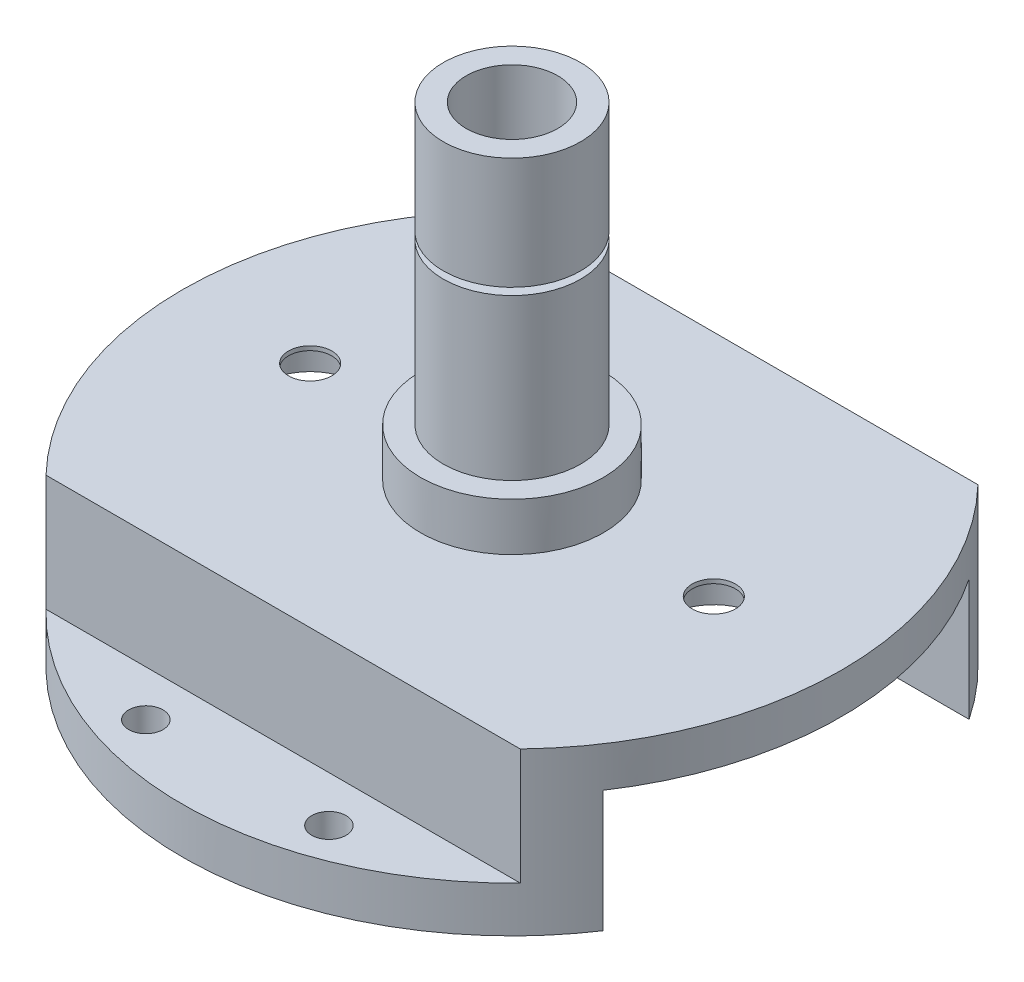
ISO-10303-21;
HEADER;
FILE_DESCRIPTION(('STEP AP214'),'2;1');
FILE_NAME('part.step','',(''),(''),'','','');
FILE_SCHEMA(('AUTOMOTIVE_DESIGN { 1 0 10303 214 1 1 1 1 }'));
ENDSEC;
DATA;
#1=APPLICATION_CONTEXT('core data for automotive mechanical design processes');
#2=APPLICATION_PROTOCOL_DEFINITION('international standard','automotive_design',2000,#1);
#3=PRODUCT_CONTEXT('',#1,'mechanical');
#4=PRODUCT('Part','Part','',(#3));
#5=PRODUCT_RELATED_PRODUCT_CATEGORY('part','',(#4));
#6=PRODUCT_DEFINITION_FORMATION('','',#4);
#7=PRODUCT_DEFINITION_CONTEXT('part definition',#1,'design');
#8=PRODUCT_DEFINITION('design','',#6,#7);
#9=PRODUCT_DEFINITION_SHAPE('','',#8);
#10=(LENGTH_UNIT() NAMED_UNIT(*) SI_UNIT(.MILLI.,.METRE.));
#11=(NAMED_UNIT(*) PLANE_ANGLE_UNIT() SI_UNIT($,.RADIAN.));
#12=(NAMED_UNIT(*) SI_UNIT($,.STERADIAN.) SOLID_ANGLE_UNIT());
#13=UNCERTAINTY_MEASURE_WITH_UNIT(LENGTH_MEASURE(1.E-05),#10,'distance_accuracy_value','');
#14=(GEOMETRIC_REPRESENTATION_CONTEXT(3) GLOBAL_UNCERTAINTY_ASSIGNED_CONTEXT((#13)) GLOBAL_UNIT_ASSIGNED_CONTEXT((#10,
#11,#12)) REPRESENTATION_CONTEXT('',''));
#15=CARTESIAN_POINT('',(0.,0.,0.));
#16=DIRECTION('',(0.,0.,1.));
#17=DIRECTION('',(1.,0.,0.));
#18=AXIS2_PLACEMENT_3D('',#15,#16,#17);
#19=CARTESIAN_POINT('',(0.,-5.587499906,0.));
#20=DIRECTION('',(0.,-1.,0.));
#21=DIRECTION('',(0.,0.,-1.));
#22=AXIS2_PLACEMENT_3D('',#19,#20,#21);
#23=PLANE('',#22);
#24=CARTESIAN_POINT('',(28.,-5.587499906,0.));
#25=DIRECTION('',(0.,-1.,0.));
#26=DIRECTION('',(0.,0.,-1.));
#27=AXIS2_PLACEMENT_3D('',#24,#25,#26);
#28=CIRCLE('',#27,6.50000000000001);
#29=CARTESIAN_POINT('',(28.,-5.587499906,-6.50000000000001));
#30=VERTEX_POINT('',#29);
#31=EDGE_CURVE('E242',#30,#30,#28,.T.);
#32=ORIENTED_EDGE('',*,*,#31,.F.);
#33=EDGE_LOOP('',(#32));
#34=FACE_BOUND('',#33,.T.);
#35=CARTESIAN_POINT('',(-28.,-5.587499906,0.));
#36=DIRECTION('',(0.,-1.,0.));
#37=DIRECTION('',(0.,0.,-1.));
#38=AXIS2_PLACEMENT_3D('',#35,#36,#37);
#39=CIRCLE('',#38,6.5);
#40=CARTESIAN_POINT('',(-28.,-5.587499906,-6.5));
#41=VERTEX_POINT('',#40);
#42=EDGE_CURVE('E168',#41,#41,#39,.T.);
#43=ORIENTED_EDGE('',*,*,#42,.F.);
#44=EDGE_LOOP('',(#43));
#45=FACE_BOUND('',#44,.T.);
#46=CARTESIAN_POINT('',(0.,-5.587499906,0.));
#47=DIRECTION('',(0.,-1.,0.));
#48=DIRECTION('',(0.,0.,-1.));
#49=AXIS2_PLACEMENT_3D('',#46,#47,#48);
#50=CIRCLE('',#49,9.525);
#51=CARTESIAN_POINT('',(0.,-5.587499906,-9.525));
#52=VERTEX_POINT('',#51);
#53=EDGE_CURVE('E125',#52,#52,#50,.T.);
#54=ORIENTED_EDGE('',*,*,#53,.F.);
#55=EDGE_LOOP('',(#54));
#56=FACE_BOUND('',#55,.T.);
#57=CARTESIAN_POINT('',(0.,-5.587499906,0.));
#58=DIRECTION('',(0.,-1.,0.));
#59=DIRECTION('',(0.,0.,-1.));
#60=AXIS2_PLACEMENT_3D('',#57,#58,#59);
#61=CIRCLE('',#60,45.72);
#62=CARTESIAN_POINT('',(38.0152390496232,-5.587499906,-25.4));
#63=VERTEX_POINT('',#62);
#64=CARTESIAN_POINT('',(38.0152390496232,-5.587499906,25.4));
#65=VERTEX_POINT('',#64);
#66=EDGE_CURVE('E123',#63,#65,#61,.T.);
#67=ORIENTED_EDGE('',*,*,#66,.T.);
#68=DIRECTION('',(1.,0.,0.));
#69=VECTOR('',#68,1.);
#70=CARTESIAN_POINT('',(0.,-5.587499906,25.4));
#71=LINE('',#70,#69);
#72=CARTESIAN_POINT('',(-38.0152390496232,-5.587499906,25.4));
#73=VERTEX_POINT('',#72);
#74=EDGE_CURVE('E219',#73,#65,#71,.T.);
#75=ORIENTED_EDGE('',*,*,#74,.F.);
#76=CARTESIAN_POINT('',(-38.0152390496232,-5.587499906,-25.4));
#77=VERTEX_POINT('',#76);
#78=EDGE_CURVE('E121',#73,#77,#61,.T.);
#79=ORIENTED_EDGE('',*,*,#78,.T.);
#80=DIRECTION('',(1.,0.,0.));
#81=VECTOR('',#80,1.);
#82=CARTESIAN_POINT('',(0.,-5.587499906,-25.4));
#83=LINE('',#82,#81);
#84=EDGE_CURVE('E173',#77,#63,#83,.T.);
#85=ORIENTED_EDGE('',*,*,#84,.T.);
#86=EDGE_LOOP('',(#67,#75,#79,#85));
#87=FACE_BOUND('',#86,.T.);
#88=ADVANCED_FACE('F37',(#34,#45,#56,#87),#23,.T.);
#89=CARTESIAN_POINT('',(28.,-5.587499906,0.));
#90=DIRECTION('',(0.,1.,0.));
#91=DIRECTION('',(0.,0.,1.));
#92=AXIS2_PLACEMENT_3D('',#89,#90,#91);
#93=CYLINDRICAL_SURFACE('',#92,3.);
#94=CARTESIAN_POINT('',(28.,0.,0.));
#95=DIRECTION('',(0.,-1.,0.));
#96=DIRECTION('',(0.,0.,-1.));
#97=AXIS2_PLACEMENT_3D('',#94,#95,#96);
#98=CIRCLE('',#97,3.);
#99=CARTESIAN_POINT('',(28.,0.,-3.));
#100=VERTEX_POINT('',#99);
#101=EDGE_CURVE('E252',#100,#100,#98,.T.);
#102=ORIENTED_EDGE('',*,*,#101,.F.);
#103=EDGE_LOOP('',(#102));
#104=FACE_BOUND('',#103,.T.);
#105=CARTESIAN_POINT('',(28.,-0.587499999999999,0.));
#106=DIRECTION('',(0.,-1.,0.));
#107=DIRECTION('',(0.,0.,-1.));
#108=AXIS2_PLACEMENT_3D('',#105,#106,#107);
#109=CIRCLE('',#108,3.);
#110=CARTESIAN_POINT('',(28.,-0.587499999999999,-3.));
#111=VERTEX_POINT('',#110);
#112=EDGE_CURVE('E165',#111,#111,#109,.T.);
#113=ORIENTED_EDGE('',*,*,#112,.T.);
#114=EDGE_LOOP('',(#113));
#115=FACE_BOUND('',#114,.T.);
#116=ADVANCED_FACE('F279',(#104,#115),#93,.F.);
#117=CARTESIAN_POINT('',(-28.,-5.587499906,0.));
#118=DIRECTION('',(0.,1.,0.));
#119=DIRECTION('',(0.,0.,1.));
#120=AXIS2_PLACEMENT_3D('',#117,#118,#119);
#121=CYLINDRICAL_SURFACE('',#120,3.);
#122=CARTESIAN_POINT('',(-28.,0.,0.));
#123=DIRECTION('',(0.,-1.,0.));
#124=DIRECTION('',(0.,0.,-1.));
#125=AXIS2_PLACEMENT_3D('',#122,#123,#124);
#126=CIRCLE('',#125,3.);
#127=CARTESIAN_POINT('',(-28.,0.,-3.));
#128=VERTEX_POINT('',#127);
#129=EDGE_CURVE('E163',#128,#128,#126,.T.);
#130=ORIENTED_EDGE('',*,*,#129,.F.);
#131=EDGE_LOOP('',(#130));
#132=FACE_BOUND('',#131,.T.);
#133=CARTESIAN_POINT('',(-28.,-0.587499999999999,0.));
#134=DIRECTION('',(0.,-1.,0.));
#135=DIRECTION('',(0.,0.,-1.));
#136=AXIS2_PLACEMENT_3D('',#133,#134,#135);
#137=CIRCLE('',#136,3.);
#138=CARTESIAN_POINT('',(-28.,-0.587499999999999,-3.));
#139=VERTEX_POINT('',#138);
#140=EDGE_CURVE('E160',#139,#139,#137,.T.);
#141=ORIENTED_EDGE('',*,*,#140,.T.);
#142=EDGE_LOOP('',(#141));
#143=FACE_BOUND('',#142,.T.);
#144=ADVANCED_FACE('F284',(#132,#143),#121,.F.);
#145=CARTESIAN_POINT('',(0.,45.3898,0.));
#146=DIRECTION('',(0.,-1.,0.));
#147=DIRECTION('',(0.,0.,-1.));
#148=AXIS2_PLACEMENT_3D('',#145,#146,#147);
#149=CYLINDRICAL_SURFACE('',#148,9.525);
#150=CARTESIAN_POINT('',(0.,6.6548,0.));
#151=DIRECTION('',(0.,1.,0.));
#152=DIRECTION('',(0.,0.,1.));
#153=AXIS2_PLACEMENT_3D('',#150,#151,#152);
#154=CIRCLE('',#153,9.525);
#155=CARTESIAN_POINT('',(0.,6.6548,9.525));
#156=VERTEX_POINT('',#155);
#157=EDGE_CURVE('E143',#156,#156,#154,.T.);
#158=ORIENTED_EDGE('',*,*,#157,.T.);
#159=EDGE_LOOP('',(#158));
#160=FACE_BOUND('',#159,.T.);
#161=CARTESIAN_POINT('',(0.,28.8798,0.));
#162=DIRECTION('',(0.,1.,0.));
#163=DIRECTION('',(0.,0.,1.));
#164=AXIS2_PLACEMENT_3D('',#161,#162,#163);
#165=CIRCLE('',#164,9.525);
#166=CARTESIAN_POINT('',(0.,28.8798,9.525));
#167=VERTEX_POINT('',#166);
#168=EDGE_CURVE('E137',#167,#167,#165,.T.);
#169=ORIENTED_EDGE('',*,*,#168,.F.);
#170=EDGE_LOOP('',(#169));
#171=FACE_BOUND('',#170,.T.);
#172=ADVANCED_FACE('F313',(#160,#171),#149,.T.);
#173=CARTESIAN_POINT('',(0.,6.6548,0.));
#174=DIRECTION('',(0.,1.,0.));
#175=DIRECTION('',(0.,0.,1.));
#176=AXIS2_PLACEMENT_3D('',#173,#174,#175);
#177=PLANE('',#176);
#178=CARTESIAN_POINT('',(0.,6.6548,0.));
#179=DIRECTION('',(0.,1.,0.));
#180=DIRECTION('',(0.,0.,1.));
#181=AXIS2_PLACEMENT_3D('',#178,#179,#180);
#182=CIRCLE('',#181,12.7);
#183=CARTESIAN_POINT('',(0.,6.6548,12.7));
#184=VERTEX_POINT('',#183);
#185=EDGE_CURVE('E153',#184,#184,#182,.T.);
#186=ORIENTED_EDGE('',*,*,#185,.T.);
#187=EDGE_LOOP('',(#186));
#188=FACE_BOUND('',#187,.T.);
#189=ORIENTED_EDGE('',*,*,#157,.F.);
#190=EDGE_LOOP('',(#189));
#191=FACE_BOUND('',#190,.T.);
#192=ADVANCED_FACE('F317',(#188,#191),#177,.T.);
#193=CARTESIAN_POINT('',(0.,0.,0.));
#194=DIRECTION('',(0.,1.,0.));
#195=DIRECTION('',(0.,0.,1.));
#196=AXIS2_PLACEMENT_3D('',#193,#194,#195);
#197=PLANE('',#196);
#198=CARTESIAN_POINT('',(0.,0.,0.));
#199=DIRECTION('',(0.,-1.,0.));
#200=DIRECTION('',(0.,0.,-1.));
#201=AXIS2_PLACEMENT_3D('',#198,#199,#200);
#202=CIRCLE('',#201,9.525);
#203=CARTESIAN_POINT('',(0.,0.,-9.525));
#204=VERTEX_POINT('',#203);
#205=EDGE_CURVE('E128',#204,#204,#202,.T.);
#206=ORIENTED_EDGE('',*,*,#205,.T.);
#207=EDGE_LOOP('',(#206));
#208=FACE_BOUND('',#207,.T.);
#209=CARTESIAN_POINT('',(0.,0.,0.));
#210=DIRECTION('',(0.,1.,0.));
#211=DIRECTION('',(0.,0.,1.));
#212=AXIS2_PLACEMENT_3D('',#209,#210,#211);
#213=CIRCLE('',#212,6.35);
#214=CARTESIAN_POINT('',(0.,0.,6.35));
#215=VERTEX_POINT('',#214);
#216=EDGE_CURVE('E148',#215,#215,#213,.T.);
#217=ORIENTED_EDGE('',*,*,#216,.T.);
#218=EDGE_LOOP('',(#217));
#219=FACE_BOUND('',#218,.T.);
#220=ADVANCED_FACE('F260',(#208,#219),#197,.F.);
#221=CARTESIAN_POINT('',(0.,6.6548,0.));
#222=DIRECTION('',(0.,-1.,0.));
#223=DIRECTION('',(0.,0.,-1.));
#224=AXIS2_PLACEMENT_3D('',#221,#222,#223);
#225=CYLINDRICAL_SURFACE('',#224,12.7);
#226=ORIENTED_EDGE('',*,*,#185,.F.);
#227=EDGE_LOOP('',(#226));
#228=FACE_BOUND('',#227,.T.);
#229=CARTESIAN_POINT('',(0.,0.,0.));
#230=DIRECTION('',(0.,-1.,0.));
#231=DIRECTION('',(0.,0.,-1.));
#232=AXIS2_PLACEMENT_3D('',#229,#230,#231);
#233=CIRCLE('',#232,12.7);
#234=CARTESIAN_POINT('',(0.,0.,-12.7));
#235=VERTEX_POINT('',#234);
#236=EDGE_CURVE('E130',#235,#235,#233,.T.);
#237=ORIENTED_EDGE('',*,*,#236,.F.);
#238=EDGE_LOOP('',(#237));
#239=FACE_BOUND('',#238,.T.);
#240=ADVANCED_FACE('F39',(#228,#239),#225,.T.);
#241=CARTESIAN_POINT('',(0.,6.6548,0.));
#242=DIRECTION('',(0.,-1.,0.));
#243=DIRECTION('',(0.,0.,-1.));
#244=AXIS2_PLACEMENT_3D('',#241,#242,#243);
#245=CYLINDRICAL_SURFACE('',#244,6.35);
#246=ORIENTED_EDGE('',*,*,#216,.F.);
#247=EDGE_LOOP('',(#246));
#248=FACE_BOUND('',#247,.T.);
#249=CARTESIAN_POINT('',(0.,45.3898,0.));
#250=DIRECTION('',(0.,1.,0.));
#251=DIRECTION('',(0.,0.,1.));
#252=AXIS2_PLACEMENT_3D('',#249,#250,#251);
#253=CIRCLE('',#252,6.35);
#254=CARTESIAN_POINT('',(0.,45.3898,6.35));
#255=VERTEX_POINT('',#254);
#256=EDGE_CURVE('E140',#255,#255,#253,.T.);
#257=ORIENTED_EDGE('',*,*,#256,.T.);
#258=EDGE_LOOP('',(#257));
#259=FACE_BOUND('',#258,.T.);
#260=ADVANCED_FACE('F308',(#248,#259),#245,.F.);
#261=CARTESIAN_POINT('',(0.,45.3898,0.));
#262=DIRECTION('',(0.,1.,0.));
#263=DIRECTION('',(0.,0.,1.));
#264=AXIS2_PLACEMENT_3D('',#261,#262,#263);
#265=PLANE('',#264);
#266=CARTESIAN_POINT('',(0.,45.3898,0.));
#267=DIRECTION('',(0.,1.,0.));
#268=DIRECTION('',(0.,0.,1.));
#269=AXIS2_PLACEMENT_3D('',#266,#267,#268);
#270=CIRCLE('',#269,9.525);
#271=CARTESIAN_POINT('',(0.,45.3898,9.525));
#272=VERTEX_POINT('',#271);
#273=EDGE_CURVE('E145',#272,#272,#270,.T.);
#274=ORIENTED_EDGE('',*,*,#273,.T.);
#275=EDGE_LOOP('',(#274));
#276=FACE_BOUND('',#275,.T.);
#277=ORIENTED_EDGE('',*,*,#256,.F.);
#278=EDGE_LOOP('',(#277));
#279=FACE_BOUND('',#278,.T.);
#280=ADVANCED_FACE('F305',(#276,#279),#265,.T.);
#281=CARTESIAN_POINT('',(0.,29.8704,0.));
#282=DIRECTION('',(0.,1.,0.));
#283=DIRECTION('',(0.,0.,1.));
#284=AXIS2_PLACEMENT_3D('',#281,#282,#283);
#285=CIRCLE('',#284,9.525);
#286=CARTESIAN_POINT('',(0.,29.8704,9.525));
#287=VERTEX_POINT('',#286);
#288=EDGE_CURVE('E144',#287,#287,#285,.T.);
#289=ORIENTED_EDGE('',*,*,#288,.T.);
#290=EDGE_LOOP('',(#289));
#291=FACE_BOUND('',#290,.T.);
#292=ORIENTED_EDGE('',*,*,#273,.F.);
#293=EDGE_LOOP('',(#292));
#294=FACE_BOUND('',#293,.T.);
#295=ADVANCED_FACE('F300',(#291,#294),#149,.T.);
#296=CARTESIAN_POINT('',(0.,29.8704,0.));
#297=DIRECTION('',(0.,1.,0.));
#298=DIRECTION('',(0.,0.,1.));
#299=AXIS2_PLACEMENT_3D('',#296,#297,#298);
#300=PLANE('',#299);
#301=CARTESIAN_POINT('',(0.,29.8704,0.));
#302=DIRECTION('',(0.,1.,0.));
#303=DIRECTION('',(0.,0.,1.));
#304=AXIS2_PLACEMENT_3D('',#301,#302,#303);
#305=CIRCLE('',#304,7.4676);
#306=CARTESIAN_POINT('',(0.,29.8704,7.4676));
#307=VERTEX_POINT('',#306);
#308=EDGE_CURVE('E134',#307,#307,#305,.T.);
#309=ORIENTED_EDGE('',*,*,#308,.T.);
#310=EDGE_LOOP('',(#309));
#311=FACE_BOUND('',#310,.T.);
#312=ORIENTED_EDGE('',*,*,#288,.F.);
#313=EDGE_LOOP('',(#312));
#314=FACE_BOUND('',#313,.T.);
#315=ADVANCED_FACE('F297',(#311,#314),#300,.F.);
#316=CARTESIAN_POINT('',(0.,28.8798,0.));
#317=DIRECTION('',(0.,1.,0.));
#318=DIRECTION('',(0.,0.,1.));
#319=AXIS2_PLACEMENT_3D('',#316,#317,#318);
#320=PLANE('',#319);
#321=CARTESIAN_POINT('',(0.,28.8798,0.));
#322=DIRECTION('',(0.,1.,0.));
#323=DIRECTION('',(0.,0.,1.));
#324=AXIS2_PLACEMENT_3D('',#321,#322,#323);
#325=CIRCLE('',#324,7.4676);
#326=CARTESIAN_POINT('',(0.,28.8798,7.4676));
#327=VERTEX_POINT('',#326);
#328=EDGE_CURVE('E133',#327,#327,#325,.T.);
#329=ORIENTED_EDGE('',*,*,#328,.F.);
#330=EDGE_LOOP('',(#329));
#331=FACE_BOUND('',#330,.T.);
#332=ORIENTED_EDGE('',*,*,#168,.T.);
#333=EDGE_LOOP('',(#332));
#334=FACE_BOUND('',#333,.T.);
#335=ADVANCED_FACE('F295',(#331,#334),#320,.T.);
#336=CARTESIAN_POINT('',(0.,29.8704,0.));
#337=DIRECTION('',(0.,-1.,0.));
#338=DIRECTION('',(0.,0.,-1.));
#339=AXIS2_PLACEMENT_3D('',#336,#337,#338);
#340=CYLINDRICAL_SURFACE('',#339,7.4676);
#341=ORIENTED_EDGE('',*,*,#308,.F.);
#342=EDGE_LOOP('',(#341));
#343=FACE_BOUND('',#342,.T.);
#344=ORIENTED_EDGE('',*,*,#328,.T.);
#345=EDGE_LOOP('',(#344));
#346=FACE_BOUND('',#345,.T.);
#347=ADVANCED_FACE('F290',(#343,#346),#340,.T.);
#348=CARTESIAN_POINT('',(0.,0.,0.));
#349=DIRECTION('',(0.,-1.,0.));
#350=DIRECTION('',(0.,0.,-1.));
#351=AXIS2_PLACEMENT_3D('',#348,#349,#350);
#352=PLANE('',#351);
#353=ORIENTED_EDGE('',*,*,#129,.T.);
#354=EDGE_LOOP('',(#353));
#355=FACE_BOUND('',#354,.T.);
#356=CARTESIAN_POINT('',(0.,0.,0.));
#357=DIRECTION('',(0.,-1.,0.));
#358=DIRECTION('',(0.,0.,-1.));
#359=AXIS2_PLACEMENT_3D('',#356,#357,#358);
#360=CIRCLE('',#359,45.72);
#361=CARTESIAN_POINT('',(32.8976579713511,0.,-31.75));
#362=VERTEX_POINT('',#361);
#363=CARTESIAN_POINT('',(32.8976579713511,0.,31.75));
#364=VERTEX_POINT('',#363);
#365=EDGE_CURVE('E116',#362,#364,#360,.T.);
#366=ORIENTED_EDGE('',*,*,#365,.F.);
#367=DIRECTION('',(1.,0.,0.));
#368=VECTOR('',#367,1.);
#369=CARTESIAN_POINT('',(45.72,0.,-31.75));
#370=LINE('',#369,#368);
#371=CARTESIAN_POINT('',(-32.8976579713511,0.,-31.75));
#372=VERTEX_POINT('',#371);
#373=EDGE_CURVE('E105',#372,#362,#370,.T.);
#374=ORIENTED_EDGE('',*,*,#373,.F.);
#375=CARTESIAN_POINT('',(-32.8976579713511,0.,31.75));
#376=VERTEX_POINT('',#375);
#377=EDGE_CURVE('E115',#376,#372,#360,.T.);
#378=ORIENTED_EDGE('',*,*,#377,.F.);
#379=DIRECTION('',(-1.,0.,0.));
#380=VECTOR('',#379,1.);
#381=CARTESIAN_POINT('',(45.72,0.,31.75));
#382=LINE('',#381,#380);
#383=EDGE_CURVE('E200',#364,#376,#382,.T.);
#384=ORIENTED_EDGE('',*,*,#383,.F.);
#385=EDGE_LOOP('',(#366,#374,#378,#384));
#386=FACE_BOUND('',#385,.T.);
#387=ORIENTED_EDGE('',*,*,#101,.T.);
#388=EDGE_LOOP('',(#387));
#389=FACE_BOUND('',#388,.T.);
#390=ORIENTED_EDGE('',*,*,#236,.T.);
#391=EDGE_LOOP('',(#390));
#392=FACE_BOUND('',#391,.T.);
#393=ADVANCED_FACE('F112',(#355,#386,#389,#392),#352,.F.);
#394=CARTESIAN_POINT('',(0.,-5.587499906,0.));
#395=DIRECTION('',(0.,1.,0.));
#396=DIRECTION('',(0.,0.,1.));
#397=AXIS2_PLACEMENT_3D('',#394,#395,#396);
#398=CYLINDRICAL_SURFACE('',#397,45.72);
#399=ORIENTED_EDGE('',*,*,#66,.F.);
#400=DIRECTION('',(0.,1.,0.));
#401=VECTOR('',#400,1.);
#402=CARTESIAN_POINT('',(38.0152390496232,-22.462499906,-25.4));
#403=LINE('',#402,#401);
#404=CARTESIAN_POINT('',(38.0152390496232,-22.462499906,-25.4));
#405=VERTEX_POINT('',#404);
#406=EDGE_CURVE('E237',#405,#63,#403,.T.);
#407=ORIENTED_EDGE('',*,*,#406,.F.);
#408=CARTESIAN_POINT('',(0.,-22.462499906,0.));
#409=DIRECTION('',(0.,-1.,0.));
#410=DIRECTION('',(0.,0.,-1.));
#411=AXIS2_PLACEMENT_3D('',#408,#409,#410);
#412=CIRCLE('',#411,45.72);
#413=CARTESIAN_POINT('',(-38.0152390496232,-22.462499906,-25.4));
#414=VERTEX_POINT('',#413);
#415=EDGE_CURVE('E236',#414,#405,#412,.T.);
#416=ORIENTED_EDGE('',*,*,#415,.F.);
#417=DIRECTION('',(0.,1.,0.));
#418=VECTOR('',#417,1.);
#419=CARTESIAN_POINT('',(-38.0152390496232,-22.462499906,-25.4));
#420=LINE('',#419,#418);
#421=EDGE_CURVE('E245',#414,#77,#420,.T.);
#422=ORIENTED_EDGE('',*,*,#421,.T.);
#423=ORIENTED_EDGE('',*,*,#78,.F.);
#424=DIRECTION('',(0.,1.,0.));
#425=VECTOR('',#424,1.);
#426=CARTESIAN_POINT('',(-38.0152390496232,-22.462499906,25.4));
#427=LINE('',#426,#425);
#428=CARTESIAN_POINT('',(-38.0152390496232,-22.462499906,25.4));
#429=VERTEX_POINT('',#428);
#430=EDGE_CURVE('E230',#429,#73,#427,.T.);
#431=ORIENTED_EDGE('',*,*,#430,.F.);
#432=CARTESIAN_POINT('',(0.,-22.462499906,0.));
#433=DIRECTION('',(0.,-1.,0.));
#434=DIRECTION('',(0.,0.,-1.));
#435=AXIS2_PLACEMENT_3D('',#432,#433,#434);
#436=CIRCLE('',#435,45.72);
#437=CARTESIAN_POINT('',(38.0152390496232,-22.462499906,25.4));
#438=VERTEX_POINT('',#437);
#439=EDGE_CURVE('E220',#438,#429,#436,.T.);
#440=ORIENTED_EDGE('',*,*,#439,.F.);
#441=DIRECTION('',(0.,1.,0.));
#442=VECTOR('',#441,1.);
#443=CARTESIAN_POINT('',(38.0152390496232,-22.462499906,25.4));
#444=LINE('',#443,#442);
#445=EDGE_CURVE('E225',#438,#65,#444,.T.);
#446=ORIENTED_EDGE('',*,*,#445,.T.);
#447=EDGE_LOOP('',(#399,#407,#416,#422,#423,#431,#440,#446));
#448=FACE_BOUND('',#447,.T.);
#449=CARTESIAN_POINT('',(0.,-16.112499906,0.));
#450=DIRECTION('',(0.,-1.,0.));
#451=DIRECTION('',(0.,0.,-1.));
#452=AXIS2_PLACEMENT_3D('',#449,#450,#451);
#453=CIRCLE('',#452,45.72);
#454=CARTESIAN_POINT('',(-32.8976579713511,-16.112499906,-31.75));
#455=VERTEX_POINT('',#454);
#456=CARTESIAN_POINT('',(32.8976579713511,-16.112499906,-31.75));
#457=VERTEX_POINT('',#456);
#458=EDGE_CURVE('E194',#455,#457,#453,.T.);
#459=ORIENTED_EDGE('',*,*,#458,.T.);
#460=DIRECTION('',(0.,1.,0.));
#461=VECTOR('',#460,1.);
#462=CARTESIAN_POINT('',(32.8976579713511,-5.587499906,-31.75));
#463=LINE('',#462,#461);
#464=EDGE_CURVE('E13',#457,#362,#463,.T.);
#465=ORIENTED_EDGE('',*,*,#464,.T.);
#466=ORIENTED_EDGE('',*,*,#365,.T.);
#467=DIRECTION('',(0.,1.,0.));
#468=VECTOR('',#467,1.);
#469=CARTESIAN_POINT('',(32.8976579713511,-5.587499906,31.75));
#470=LINE('',#469,#468);
#471=CARTESIAN_POINT('',(32.8976579713511,-16.112499906,31.75));
#472=VERTEX_POINT('',#471);
#473=EDGE_CURVE('E108',#364,#472,#470,.F.);
#474=ORIENTED_EDGE('',*,*,#473,.T.);
#475=CARTESIAN_POINT('',(0.,-16.112499906,0.));
#476=DIRECTION('',(0.,-1.,0.));
#477=DIRECTION('',(0.,0.,-1.));
#478=AXIS2_PLACEMENT_3D('',#475,#476,#477);
#479=CIRCLE('',#478,45.72);
#480=CARTESIAN_POINT('',(-32.8976579713511,-16.112499906,31.75));
#481=VERTEX_POINT('',#480);
#482=EDGE_CURVE('E205',#472,#481,#479,.T.);
#483=ORIENTED_EDGE('',*,*,#482,.T.);
#484=DIRECTION('',(0.,1.,0.));
#485=VECTOR('',#484,1.);
#486=CARTESIAN_POINT('',(-32.8976579713511,-5.587499906,31.75));
#487=LINE('',#486,#485);
#488=EDGE_CURVE('E120',#481,#376,#487,.T.);
#489=ORIENTED_EDGE('',*,*,#488,.T.);
#490=ORIENTED_EDGE('',*,*,#377,.T.);
#491=DIRECTION('',(0.,1.,0.));
#492=VECTOR('',#491,1.);
#493=CARTESIAN_POINT('',(-32.8976579713511,-5.587499906,-31.75));
#494=LINE('',#493,#492);
#495=EDGE_CURVE('E45',#372,#455,#494,.F.);
#496=ORIENTED_EDGE('',*,*,#495,.T.);
#497=EDGE_LOOP('',(#459,#465,#466,#474,#483,#489,#490,#496));
#498=FACE_BOUND('',#497,.T.);
#499=ADVANCED_FACE('F119',(#448,#498),#398,.T.);
#500=CARTESIAN_POINT('',(0.,-5.587499906,0.));
#501=DIRECTION('',(0.,1.,0.));
#502=DIRECTION('',(0.,0.,1.));
#503=AXIS2_PLACEMENT_3D('',#500,#501,#502);
#504=CYLINDRICAL_SURFACE('',#503,9.525);
#505=ORIENTED_EDGE('',*,*,#53,.T.);
#506=EDGE_LOOP('',(#505));
#507=FACE_BOUND('',#506,.T.);
#508=ORIENTED_EDGE('',*,*,#205,.F.);
#509=EDGE_LOOP('',(#508));
#510=FACE_BOUND('',#509,.T.);
#511=ADVANCED_FACE('F263',(#507,#510),#504,.F.);
#512=CARTESIAN_POINT('',(-28.,-0.587499999999999,0.));
#513=DIRECTION('',(0.,-1.,0.));
#514=DIRECTION('',(0.,0.,-1.));
#515=AXIS2_PLACEMENT_3D('',#512,#513,#514);
#516=CYLINDRICAL_SURFACE('',#515,6.5);
#517=CARTESIAN_POINT('',(-28.,-0.587499999999999,0.));
#518=DIRECTION('',(0.,-1.,0.));
#519=DIRECTION('',(0.,0.,-1.));
#520=AXIS2_PLACEMENT_3D('',#517,#518,#519);
#521=CIRCLE('',#520,6.5);
#522=CARTESIAN_POINT('',(-28.,-0.587499999999999,-6.5));
#523=VERTEX_POINT('',#522);
#524=EDGE_CURVE('E164',#523,#523,#521,.T.);
#525=ORIENTED_EDGE('',*,*,#524,.F.);
#526=EDGE_LOOP('',(#525));
#527=FACE_BOUND('',#526,.T.);
#528=ORIENTED_EDGE('',*,*,#42,.T.);
#529=EDGE_LOOP('',(#528));
#530=FACE_BOUND('',#529,.T.);
#531=ADVANCED_FACE('F265',(#527,#530),#516,.F.);
#532=CARTESIAN_POINT('',(-28.,-0.587499999999999,0.));
#533=DIRECTION('',(0.,-1.,0.));
#534=DIRECTION('',(0.,0.,-1.));
#535=AXIS2_PLACEMENT_3D('',#532,#533,#534);
#536=PLANE('',#535);
#537=ORIENTED_EDGE('',*,*,#140,.F.);
#538=EDGE_LOOP('',(#537));
#539=FACE_BOUND('',#538,.T.);
#540=ORIENTED_EDGE('',*,*,#524,.T.);
#541=EDGE_LOOP('',(#540));
#542=FACE_BOUND('',#541,.T.);
#543=ADVANCED_FACE('F271',(#539,#542),#536,.T.);
#544=CARTESIAN_POINT('',(28.,-0.587499999999999,0.));
#545=DIRECTION('',(0.,-1.,0.));
#546=DIRECTION('',(0.,0.,-1.));
#547=AXIS2_PLACEMENT_3D('',#544,#545,#546);
#548=CYLINDRICAL_SURFACE('',#547,6.50000000000001);
#549=CARTESIAN_POINT('',(28.,-0.587499999999999,0.));
#550=DIRECTION('',(0.,-1.,0.));
#551=DIRECTION('',(0.,0.,-1.));
#552=AXIS2_PLACEMENT_3D('',#549,#550,#551);
#553=CIRCLE('',#552,6.50000000000001);
#554=CARTESIAN_POINT('',(28.,-0.587499999999999,-6.50000000000001));
#555=VERTEX_POINT('',#554);
#556=EDGE_CURVE('E169',#555,#555,#553,.T.);
#557=ORIENTED_EDGE('',*,*,#556,.F.);
#558=EDGE_LOOP('',(#557));
#559=FACE_BOUND('',#558,.T.);
#560=ORIENTED_EDGE('',*,*,#31,.T.);
#561=EDGE_LOOP('',(#560));
#562=FACE_BOUND('',#561,.T.);
#563=ADVANCED_FACE('F350',(#559,#562),#548,.F.);
#564=CARTESIAN_POINT('',(28.,-0.587499999999999,0.));
#565=DIRECTION('',(0.,-1.,0.));
#566=DIRECTION('',(0.,0.,-1.));
#567=AXIS2_PLACEMENT_3D('',#564,#565,#566);
#568=PLANE('',#567);
#569=ORIENTED_EDGE('',*,*,#112,.F.);
#570=EDGE_LOOP('',(#569));
#571=FACE_BOUND('',#570,.T.);
#572=ORIENTED_EDGE('',*,*,#556,.T.);
#573=EDGE_LOOP('',(#572));
#574=FACE_BOUND('',#573,.T.);
#575=ADVANCED_FACE('F354',(#571,#574),#568,.T.);
#576=CARTESIAN_POINT('',(0.,-22.462499906,-25.4));
#577=DIRECTION('',(0.,0.,1.));
#578=DIRECTION('',(1.,0.,0.));
#579=AXIS2_PLACEMENT_3D('',#576,#577,#578);
#580=PLANE('',#579);
#581=ORIENTED_EDGE('',*,*,#84,.F.);
#582=ORIENTED_EDGE('',*,*,#421,.F.);
#583=DIRECTION('',(1.,0.,0.));
#584=VECTOR('',#583,1.);
#585=CARTESIAN_POINT('',(0.,-22.462499906,-25.4));
#586=LINE('',#585,#584);
#587=EDGE_CURVE('E233',#414,#405,#586,.T.);
#588=ORIENTED_EDGE('',*,*,#587,.T.);
#589=ORIENTED_EDGE('',*,*,#406,.T.);
#590=EDGE_LOOP('',(#581,#582,#588,#589));
#591=FACE_BOUND('',#590,.T.);
#592=ADVANCED_FACE('F358',(#591),#580,.T.);
#593=CARTESIAN_POINT('',(0.,-22.462499906,0.));
#594=DIRECTION('',(0.,-1.,0.));
#595=DIRECTION('',(0.,0.,-1.));
#596=AXIS2_PLACEMENT_3D('',#593,#594,#595);
#597=PLANE('',#596);
#598=CARTESIAN_POINT('',(12.7,-22.462499906,-38.1));
#599=DIRECTION('',(0.,-1.,0.));
#600=DIRECTION('',(0.,0.,1.));
#601=AXIS2_PLACEMENT_3D('',#598,#599,#600);
#602=CIRCLE('',#601,2.38125);
#603=CARTESIAN_POINT('',(12.7,-22.462499906,-35.71875));
#604=VERTEX_POINT('',#603);
#605=EDGE_CURVE('E207',#604,#604,#602,.T.);
#606=ORIENTED_EDGE('',*,*,#605,.F.);
#607=EDGE_LOOP('',(#606));
#608=FACE_BOUND('',#607,.T.);
#609=CARTESIAN_POINT('',(-12.7,-22.462499906,-38.1));
#610=DIRECTION('',(0.,-1.,0.));
#611=DIRECTION('',(0.,0.,1.));
#612=AXIS2_PLACEMENT_3D('',#609,#610,#611);
#613=CIRCLE('',#612,2.38125);
#614=CARTESIAN_POINT('',(-12.7,-22.462499906,-35.71875));
#615=VERTEX_POINT('',#614);
#616=EDGE_CURVE('E210',#615,#615,#613,.T.);
#617=ORIENTED_EDGE('',*,*,#616,.F.);
#618=EDGE_LOOP('',(#617));
#619=FACE_BOUND('',#618,.T.);
#620=ORIENTED_EDGE('',*,*,#587,.F.);
#621=ORIENTED_EDGE('',*,*,#415,.T.);
#622=EDGE_LOOP('',(#620,#621));
#623=FACE_BOUND('',#622,.T.);
#624=ADVANCED_FACE('F362',(#608,#619,#623),#597,.T.);
#625=CARTESIAN_POINT('',(0.,-22.462499906,25.4));
#626=DIRECTION('',(0.,0.,1.));
#627=DIRECTION('',(1.,0.,0.));
#628=AXIS2_PLACEMENT_3D('',#625,#626,#627);
#629=PLANE('',#628);
#630=ORIENTED_EDGE('',*,*,#74,.T.);
#631=ORIENTED_EDGE('',*,*,#445,.F.);
#632=DIRECTION('',(1.,0.,0.));
#633=VECTOR('',#632,1.);
#634=CARTESIAN_POINT('',(0.,-22.462499906,25.4));
#635=LINE('',#634,#633);
#636=EDGE_CURVE('E223',#429,#438,#635,.T.);
#637=ORIENTED_EDGE('',*,*,#636,.F.);
#638=ORIENTED_EDGE('',*,*,#430,.T.);
#639=EDGE_LOOP('',(#630,#631,#637,#638));
#640=FACE_BOUND('',#639,.T.);
#641=ADVANCED_FACE('F366',(#640),#629,.F.);
#642=CARTESIAN_POINT('',(0.,-22.462499906,0.));
#643=DIRECTION('',(0.,-1.,0.));
#644=DIRECTION('',(0.,0.,-1.));
#645=AXIS2_PLACEMENT_3D('',#642,#643,#644);
#646=PLANE('',#645);
#647=CARTESIAN_POINT('',(-12.7,-22.462499906,38.1));
#648=DIRECTION('',(0.,-1.,0.));
#649=DIRECTION('',(0.,0.,-1.));
#650=AXIS2_PLACEMENT_3D('',#647,#648,#649);
#651=CIRCLE('',#650,2.38125);
#652=CARTESIAN_POINT('',(-12.7,-22.462499906,35.71875));
#653=VERTEX_POINT('',#652);
#654=EDGE_CURVE('E213',#653,#653,#651,.T.);
#655=ORIENTED_EDGE('',*,*,#654,.F.);
#656=EDGE_LOOP('',(#655));
#657=FACE_BOUND('',#656,.T.);
#658=CARTESIAN_POINT('',(12.7,-22.462499906,38.1));
#659=DIRECTION('',(0.,-1.,0.));
#660=DIRECTION('',(0.,0.,-1.));
#661=AXIS2_PLACEMENT_3D('',#658,#659,#660);
#662=CIRCLE('',#661,2.38125);
#663=CARTESIAN_POINT('',(12.7,-22.462499906,35.71875));
#664=VERTEX_POINT('',#663);
#665=EDGE_CURVE('E216',#664,#664,#662,.T.);
#666=ORIENTED_EDGE('',*,*,#665,.F.);
#667=EDGE_LOOP('',(#666));
#668=FACE_BOUND('',#667,.T.);
#669=ORIENTED_EDGE('',*,*,#439,.T.);
#670=ORIENTED_EDGE('',*,*,#636,.T.);
#671=EDGE_LOOP('',(#669,#670));
#672=FACE_BOUND('',#671,.T.);
#673=ADVANCED_FACE('F370',(#657,#668,#672),#646,.T.);
#674=CARTESIAN_POINT('',(12.7,6.73519209080187,38.1));
#675=DIRECTION('',(0.,-1.,0.));
#676=DIRECTION('',(0.,0.,-1.));
#677=AXIS2_PLACEMENT_3D('',#674,#675,#676);
#678=CYLINDRICAL_SURFACE('',#677,2.38125);
#679=CARTESIAN_POINT('',(12.7,-16.112499906,38.1));
#680=DIRECTION('',(0.,-1.,0.));
#681=DIRECTION('',(0.,0.,-1.));
#682=AXIS2_PLACEMENT_3D('',#679,#680,#681);
#683=CIRCLE('',#682,2.38125);
#684=CARTESIAN_POINT('',(12.7,-16.112499906,35.71875));
#685=VERTEX_POINT('',#684);
#686=EDGE_CURVE('E184',#685,#685,#683,.F.);
#687=ORIENTED_EDGE('',*,*,#686,.T.);
#688=EDGE_LOOP('',(#687));
#689=FACE_BOUND('',#688,.T.);
#690=ORIENTED_EDGE('',*,*,#665,.T.);
#691=EDGE_LOOP('',(#690));
#692=FACE_BOUND('',#691,.T.);
#693=ADVANCED_FACE('F374',(#689,#692),#678,.F.);
#694=CARTESIAN_POINT('',(-12.7,6.73519209080187,38.1));
#695=DIRECTION('',(0.,-1.,0.));
#696=DIRECTION('',(0.,0.,-1.));
#697=AXIS2_PLACEMENT_3D('',#694,#695,#696);
#698=CYLINDRICAL_SURFACE('',#697,2.38125);
#699=CARTESIAN_POINT('',(-12.7,-16.112499906,38.1));
#700=DIRECTION('',(0.,-1.,0.));
#701=DIRECTION('',(0.,0.,-1.));
#702=AXIS2_PLACEMENT_3D('',#699,#700,#701);
#703=CIRCLE('',#702,2.38125);
#704=CARTESIAN_POINT('',(-12.7,-16.112499906,35.71875));
#705=VERTEX_POINT('',#704);
#706=EDGE_CURVE('E181',#705,#705,#703,.F.);
#707=ORIENTED_EDGE('',*,*,#706,.T.);
#708=EDGE_LOOP('',(#707));
#709=FACE_BOUND('',#708,.T.);
#710=ORIENTED_EDGE('',*,*,#654,.T.);
#711=EDGE_LOOP('',(#710));
#712=FACE_BOUND('',#711,.T.);
#713=ADVANCED_FACE('F378',(#709,#712),#698,.F.);
#714=CARTESIAN_POINT('',(-12.7,6.73519209080187,-38.1));
#715=DIRECTION('',(0.,-1.,0.));
#716=DIRECTION('',(0.,0.,-1.));
#717=AXIS2_PLACEMENT_3D('',#714,#715,#716);
#718=CYLINDRICAL_SURFACE('',#717,2.38125);
#719=CARTESIAN_POINT('',(-12.7,-16.112499906,-38.1));
#720=DIRECTION('',(0.,-1.,0.));
#721=DIRECTION('',(0.,0.,-1.));
#722=AXIS2_PLACEMENT_3D('',#719,#720,#721);
#723=CIRCLE('',#722,2.38125);
#724=CARTESIAN_POINT('',(-12.7,-16.112499906,-40.48125));
#725=VERTEX_POINT('',#724);
#726=EDGE_CURVE('E190',#725,#725,#723,.F.);
#727=ORIENTED_EDGE('',*,*,#726,.T.);
#728=EDGE_LOOP('',(#727));
#729=FACE_BOUND('',#728,.T.);
#730=ORIENTED_EDGE('',*,*,#616,.T.);
#731=EDGE_LOOP('',(#730));
#732=FACE_BOUND('',#731,.T.);
#733=ADVANCED_FACE('F382',(#729,#732),#718,.F.);
#734=CARTESIAN_POINT('',(12.7,6.73519209080187,-38.1));
#735=DIRECTION('',(0.,-1.,0.));
#736=DIRECTION('',(0.,0.,-1.));
#737=AXIS2_PLACEMENT_3D('',#734,#735,#736);
#738=CYLINDRICAL_SURFACE('',#737,2.38125);
#739=CARTESIAN_POINT('',(12.7,-16.112499906,-38.1));
#740=DIRECTION('',(0.,-1.,0.));
#741=DIRECTION('',(0.,0.,-1.));
#742=AXIS2_PLACEMENT_3D('',#739,#740,#741);
#743=CIRCLE('',#742,2.38125);
#744=CARTESIAN_POINT('',(12.7,-16.112499906,-40.48125));
#745=VERTEX_POINT('',#744);
#746=EDGE_CURVE('E188',#745,#745,#743,.F.);
#747=ORIENTED_EDGE('',*,*,#746,.T.);
#748=EDGE_LOOP('',(#747));
#749=FACE_BOUND('',#748,.T.);
#750=ORIENTED_EDGE('',*,*,#605,.T.);
#751=EDGE_LOOP('',(#750));
#752=FACE_BOUND('',#751,.T.);
#753=ADVANCED_FACE('F386',(#749,#752),#738,.F.);
#754=CARTESIAN_POINT('',(45.72,-114.963497197921,31.75));
#755=DIRECTION('',(0.,0.,-1.));
#756=DIRECTION('',(-1.,0.,0.));
#757=AXIS2_PLACEMENT_3D('',#754,#755,#756);
#758=PLANE('',#757);
#759=DIRECTION('',(-1.,0.,0.));
#760=VECTOR('',#759,1.);
#761=CARTESIAN_POINT('',(45.72,-16.112499906,31.75));
#762=LINE('',#761,#760);
#763=EDGE_CURVE('E60',#472,#481,#762,.T.);
#764=ORIENTED_EDGE('',*,*,#763,.F.);
#765=ORIENTED_EDGE('',*,*,#473,.F.);
#766=ORIENTED_EDGE('',*,*,#383,.T.);
#767=ORIENTED_EDGE('',*,*,#488,.F.);
#768=EDGE_LOOP('',(#764,#765,#766,#767));
#769=FACE_BOUND('',#768,.T.);
#770=ADVANCED_FACE('F390',(#769),#758,.F.);
#771=CARTESIAN_POINT('',(0.,-16.112499906,0.));
#772=DIRECTION('',(0.,-1.,0.));
#773=DIRECTION('',(0.,0.,-1.));
#774=AXIS2_PLACEMENT_3D('',#771,#772,#773);
#775=PLANE('',#774);
#776=ORIENTED_EDGE('',*,*,#706,.F.);
#777=EDGE_LOOP('',(#776));
#778=FACE_BOUND('',#777,.T.);
#779=ORIENTED_EDGE('',*,*,#686,.F.);
#780=EDGE_LOOP('',(#779));
#781=FACE_BOUND('',#780,.T.);
#782=ORIENTED_EDGE('',*,*,#763,.T.);
#783=ORIENTED_EDGE('',*,*,#482,.F.);
#784=EDGE_LOOP('',(#782,#783));
#785=FACE_BOUND('',#784,.T.);
#786=ADVANCED_FACE('F391',(#778,#781,#785),#775,.F.);
#787=CARTESIAN_POINT('',(45.72,-114.963497197921,-31.75));
#788=DIRECTION('',(0.,0.,1.));
#789=DIRECTION('',(1.,0.,0.));
#790=AXIS2_PLACEMENT_3D('',#787,#788,#789);
#791=PLANE('',#790);
#792=DIRECTION('',(1.,0.,0.));
#793=VECTOR('',#792,1.);
#794=CARTESIAN_POINT('',(45.72,-16.112499906,-31.75));
#795=LINE('',#794,#793);
#796=EDGE_CURVE('E52',#455,#457,#795,.T.);
#797=ORIENTED_EDGE('',*,*,#796,.F.);
#798=ORIENTED_EDGE('',*,*,#495,.F.);
#799=ORIENTED_EDGE('',*,*,#373,.T.);
#800=ORIENTED_EDGE('',*,*,#464,.F.);
#801=EDGE_LOOP('',(#797,#798,#799,#800));
#802=FACE_BOUND('',#801,.T.);
#803=ADVANCED_FACE('F104',(#802),#791,.F.);
#804=CARTESIAN_POINT('',(0.,-16.112499906,0.));
#805=DIRECTION('',(0.,-1.,0.));
#806=DIRECTION('',(0.,0.,-1.));
#807=AXIS2_PLACEMENT_3D('',#804,#805,#806);
#808=PLANE('',#807);
#809=ORIENTED_EDGE('',*,*,#746,.F.);
#810=EDGE_LOOP('',(#809));
#811=FACE_BOUND('',#810,.T.);
#812=ORIENTED_EDGE('',*,*,#726,.F.);
#813=EDGE_LOOP('',(#812));
#814=FACE_BOUND('',#813,.T.);
#815=ORIENTED_EDGE('',*,*,#458,.F.);
#816=ORIENTED_EDGE('',*,*,#796,.T.);
#817=EDGE_LOOP('',(#815,#816));
#818=FACE_BOUND('',#817,.T.);
#819=ADVANCED_FACE('F397',(#811,#814,#818),#808,.F.);
#820=CLOSED_SHELL('',(#88,#116,#144,#172,#192,#220,#240,#260,#280,#295,#315,#335,#347,#393,#499,
#511,#531,#543,#563,#575,#592,#624,#641,#673,#693,#713,#733,#753,#770,#786,#803,#819));
#821=MANIFOLD_SOLID_BREP('B2',#820);
#822=ADVANCED_BREP_SHAPE_REPRESENTATION('',(#18,#821),#14);
#823=SHAPE_DEFINITION_REPRESENTATION(#9,#822);
ENDSEC;
END-ISO-10303-21;
